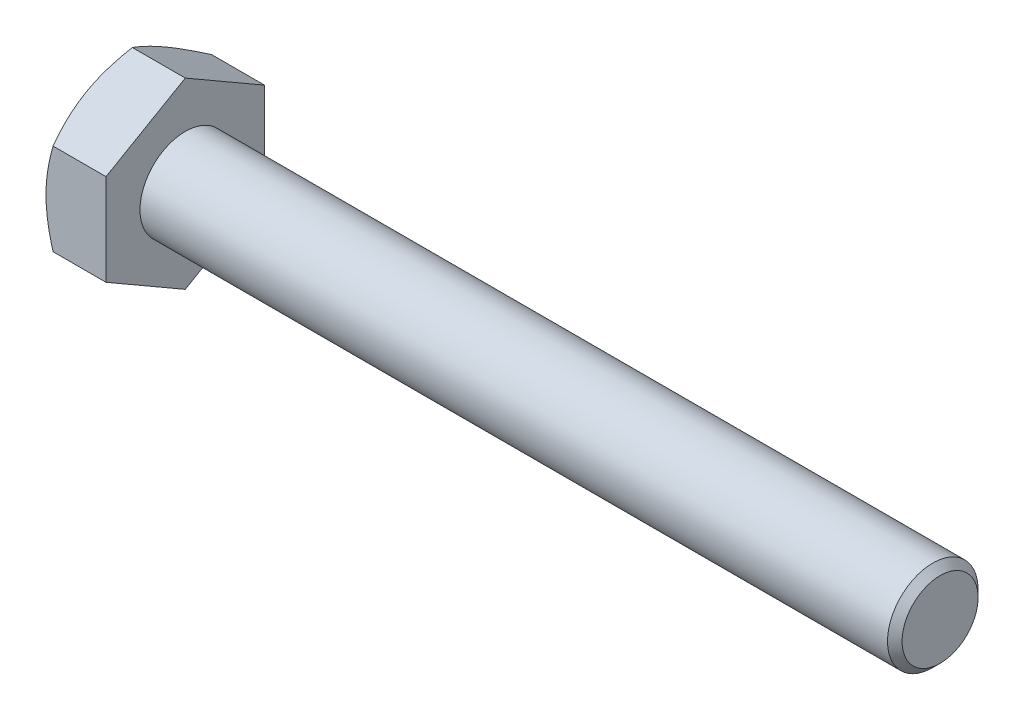
ISO-10303-21;
HEADER;
FILE_DESCRIPTION(('STEP AP214'),'2;1');
FILE_NAME('part.step','',(''),(''),'','','');
FILE_SCHEMA(('AUTOMOTIVE_DESIGN { 1 0 10303 214 1 1 1 1 }'));
ENDSEC;
DATA;
#1=APPLICATION_CONTEXT('core data for automotive mechanical design processes');
#2=APPLICATION_PROTOCOL_DEFINITION('international standard','automotive_design',2000,#1);
#3=PRODUCT_CONTEXT('',#1,'mechanical');
#4=PRODUCT('Part','Part','',(#3));
#5=PRODUCT_RELATED_PRODUCT_CATEGORY('part','',(#4));
#6=PRODUCT_DEFINITION_FORMATION('','',#4);
#7=PRODUCT_DEFINITION_CONTEXT('part definition',#1,'design');
#8=PRODUCT_DEFINITION('design','',#6,#7);
#9=PRODUCT_DEFINITION_SHAPE('','',#8);
#10=(LENGTH_UNIT() NAMED_UNIT(*) SI_UNIT(.MILLI.,.METRE.));
#11=(NAMED_UNIT(*) PLANE_ANGLE_UNIT() SI_UNIT($,.RADIAN.));
#12=(NAMED_UNIT(*) SI_UNIT($,.STERADIAN.) SOLID_ANGLE_UNIT());
#13=UNCERTAINTY_MEASURE_WITH_UNIT(LENGTH_MEASURE(1.E-05),#10,'distance_accuracy_value','');
#14=(GEOMETRIC_REPRESENTATION_CONTEXT(3) GLOBAL_UNCERTAINTY_ASSIGNED_CONTEXT((#13)) GLOBAL_UNIT_ASSIGNED_CONTEXT((#10,
#11,#12)) REPRESENTATION_CONTEXT('',''));
#15=CARTESIAN_POINT('',(0.,0.,0.));
#16=DIRECTION('',(0.,0.,1.));
#17=DIRECTION('',(1.,0.,0.));
#18=AXIS2_PLACEMENT_3D('',#15,#16,#17);
#19=CARTESIAN_POINT('',(7.95,6.06217782649107,-10.5));
#20=DIRECTION('',(0.,-0.866025403784438,0.500000000000001));
#21=DIRECTION('',(0.,-0.500000000000001,-0.866025403784438));
#22=AXIS2_PLACEMENT_3D('',#19,#20,#21);
#23=PLANE('',#22);
#24=CARTESIAN_POINT('',(0.93788884112796,12.124471123036,0.000200000000000418));
#25=CARTESIAN_POINT('',(0.860963916074867,11.9912113022033,-0.230612780289705));
#26=CARTESIAN_POINT('',(0.787530383052679,11.8574546192679,-0.462286150985755));
#27=CARTESIAN_POINT('',(0.648614855969205,11.588868624868,-0.92749073948774));
#28=CARTESIAN_POINT('',(0.583135477152654,11.4540389760651,-1.16102254158105));
#29=CARTESIAN_POINT('',(0.399895760205337,11.0473775223377,-1.86538084091668));
#30=CARTESIAN_POINT('',(0.295669956057561,10.7739403689788,-2.33898788321127));
#31=CARTESIAN_POINT('',(0.173455649415438,10.3647541884679,-3.04771913761132));
#32=CARTESIAN_POINT('',(0.138641420005218,10.2302276268794,-3.28072597725015));
#33=CARTESIAN_POINT('',(0.0802602632087882,9.96055165836838,-3.74781845629153));
#34=CARTESIAN_POINT('',(0.0566935523025239,9.82540223950837,-3.98190411637048));
#35=CARTESIAN_POINT('',(0.0214112687997663,9.554877967591,-4.45046590001193));
#36=CARTESIAN_POINT('',(0.00968161306977366,9.41950357481883,-4.68494122633711));
#37=CARTESIAN_POINT('',(-0.00167731742386433,9.14862975072206,-5.1541084521132));
#38=CARTESIAN_POINT('',(-0.00130696605018146,9.0131303233901,-5.38880034464865));
#39=CARTESIAN_POINT('',(0.0106922674925489,8.75981159790078,-5.82756124770474));
#40=CARTESIAN_POINT('',(0.0208573916341296,8.64197441901424,-6.03166122855681));
#41=CARTESIAN_POINT('',(0.0501416022118139,8.40657565830019,-6.43938384215228));
#42=CARTESIAN_POINT('',(0.0692613220254895,8.28901409655892,-6.64300644010531));
#43=CARTESIAN_POINT('',(0.139600342172595,7.93678493717292,-7.25308524006914));
#44=CARTESIAN_POINT('',(0.20379073970833,7.70274080802587,-7.65846156296505));
#45=CARTESIAN_POINT('',(0.364267089688398,7.23216993554936,-8.47351422265637));
#46=CARTESIAN_POINT('',(0.461233267874617,6.99570324614096,-8.88308654300932));
#47=CARTESIAN_POINT('',(0.681306134881991,6.52629611674996,-9.69612354054959));
#48=CARTESIAN_POINT('',(0.804361137283483,6.29334966603591,-10.0995986286292));
#49=CARTESIAN_POINT('',(0.937888841127954,6.06206235643723,-10.5002));
#50=B_SPLINE_CURVE_WITH_KNOTS('',3,(#24,#25,#26,#27,#28,#29,#30,#31,#32,#33,#34,#35,#36,#37,#38,
#39,#40,#41,#42,#43,#44,#45,#46,#47,#48,#49),.UNSPECIFIED.,.F.,.F.,(4,2,2,2,2,2,2,2,2,2,2,2,4),
(0.,0.832130250860041,1.66453336135423,3.33288308532808,4.14658222524688,4.9602970257261,
5.77304256378741,6.58576298988571,7.29326708484993,8.00082123064117,9.41693497455991,
10.864454487818,12.3091325775355),.UNSPECIFIED.);
#51=CARTESIAN_POINT('',(0.937822173508921,12.1243556529821,0.));
#52=VERTEX_POINT('',#51);
#53=CARTESIAN_POINT('',(0.,9.0932667397366,-5.25000000000001));
#54=VERTEX_POINT('',#53);
#55=EDGE_CURVE('E50',#52,#54,#50,.T.);
#56=ORIENTED_EDGE('',*,*,#55,.F.);
#57=DIRECTION('',(-1.,0.,0.));
#58=VECTOR('',#57,1.);
#59=CARTESIAN_POINT('',(7.95,12.1243556529821,0.));
#60=LINE('',#59,#58);
#61=CARTESIAN_POINT('',(7.95,12.1243556529821,0.));
#62=VERTEX_POINT('',#61);
#63=EDGE_CURVE('E146',#62,#52,#60,.T.);
#64=ORIENTED_EDGE('',*,*,#63,.F.);
#65=DIRECTION('',(0.,0.500000000000001,0.866025403784438));
#66=VECTOR('',#65,1.);
#67=CARTESIAN_POINT('',(7.95,6.06217782649107,-10.5));
#68=LINE('',#67,#66);
#69=CARTESIAN_POINT('',(7.95,6.06217782649107,-10.5));
#70=VERTEX_POINT('',#69);
#71=EDGE_CURVE('E231',#70,#62,#68,.T.);
#72=ORIENTED_EDGE('',*,*,#71,.F.);
#73=DIRECTION('',(-1.,0.,0.));
#74=VECTOR('',#73,1.);
#75=CARTESIAN_POINT('',(7.95,6.06217782649107,-10.5));
#76=LINE('',#75,#74);
#77=CARTESIAN_POINT('',(0.937822173508914,6.06217782649107,-10.5));
#78=VERTEX_POINT('',#77);
#79=EDGE_CURVE('E134',#70,#78,#76,.T.);
#80=ORIENTED_EDGE('',*,*,#79,.T.);
#81=EDGE_CURVE('E128',#54,#78,#50,.T.);
#82=ORIENTED_EDGE('',*,*,#81,.F.);
#83=EDGE_LOOP('',(#56,#64,#72,#80,#82));
#84=FACE_BOUND('',#83,.T.);
#85=ADVANCED_FACE('F34',(#84),#23,.F.);
#86=CARTESIAN_POINT('',(7.95,12.1243556529821,0.));
#87=DIRECTION('',(0.,-0.866025403784438,-0.500000000000001));
#88=DIRECTION('',(0.,0.500000000000001,-0.866025403784438));
#89=AXIS2_PLACEMENT_3D('',#86,#87,#88);
#90=PLANE('',#89);
#91=CARTESIAN_POINT('',(0.937888841127953,6.06206235643723,10.5002));
#92=CARTESIAN_POINT('',(0.860963916074859,6.19532217726989,10.2693872197103));
#93=CARTESIAN_POINT('',(0.787530383052672,6.32907886020533,10.0377138490142));
#94=CARTESIAN_POINT('',(0.648614855969198,6.5976648546052,9.57250926051226));
#95=CARTESIAN_POINT('',(0.583135477152648,6.7324945034081,9.33897745841895));
#96=CARTESIAN_POINT('',(0.399895760205332,7.13915595713548,8.63461915908332));
#97=CARTESIAN_POINT('',(0.295669956057556,7.41259311049437,8.16101211678873));
#98=CARTESIAN_POINT('',(0.173455649415434,7.82177929100534,7.45228086238868));
#99=CARTESIAN_POINT('',(0.138641420005215,7.95630585259384,7.21927402274985));
#100=CARTESIAN_POINT('',(0.0802602632087853,8.22598182110483,6.75218154370847));
#101=CARTESIAN_POINT('',(0.0566935523025206,8.36113123996485,6.51809588362952));
#102=CARTESIAN_POINT('',(0.0214112687997636,8.63165551188221,6.04953409998807));
#103=CARTESIAN_POINT('',(0.0096816130697718,8.76702990465438,5.81505877366289));
#104=CARTESIAN_POINT('',(-0.00167731742386547,9.03790372875115,5.3458915478868));
#105=CARTESIAN_POINT('',(-0.00130696605018271,9.17340315608311,5.11119965535136));
#106=CARTESIAN_POINT('',(0.0106922674925486,9.42672188157244,4.67243875229526));
#107=CARTESIAN_POINT('',(0.0208573916341302,9.54455906045897,4.46833877144319));
#108=CARTESIAN_POINT('',(0.0501416022118153,9.77995782117302,4.06061615784772));
#109=CARTESIAN_POINT('',(0.0692613220254909,9.89751938291429,3.85699355989469));
#110=CARTESIAN_POINT('',(0.139600342172597,10.2497485423003,3.24691475993086));
#111=CARTESIAN_POINT('',(0.203790739708332,10.4837926714473,2.84153843703495));
#112=CARTESIAN_POINT('',(0.364267089688401,10.9543635439239,2.02648577734363));
#113=CARTESIAN_POINT('',(0.46123326787462,11.1908302333322,1.61691345699068));
#114=CARTESIAN_POINT('',(0.681306134881996,11.6602373627233,0.803876459450407));
#115=CARTESIAN_POINT('',(0.804361137283488,11.8931838134373,0.400401371370838));
#116=CARTESIAN_POINT('',(0.93788884112796,12.124471123036,-0.000200000000000133));
#117=B_SPLINE_CURVE_WITH_KNOTS('',3,(#91,#92,#93,#94,#95,#96,#97,#98,#99,#100,#101,#102,#103,
#104,#105,#106,#107,#108,#109,#110,#111,#112,#113,#114,#115,#116),.UNSPECIFIED.,.F.,.F.,(4,2,2,
2,2,2,2,2,2,2,2,2,4),(0.,0.832130250860039,1.66453336135423,3.33288308532807,4.14658222524688,
4.96029702572609,5.77304256378741,6.5857629898857,7.29326708484992,8.00082123064116,
9.41693497455991,10.864454487818,12.3091325775355),.UNSPECIFIED.);
#118=CARTESIAN_POINT('',(0.937822173508914,6.06217782649106,10.5));
#119=VERTEX_POINT('',#118);
#120=CARTESIAN_POINT('',(0.,9.0932667397366,5.25000000000001));
#121=VERTEX_POINT('',#120);
#122=EDGE_CURVE('E57',#119,#121,#117,.T.);
#123=ORIENTED_EDGE('',*,*,#122,.F.);
#124=DIRECTION('',(-1.,0.,0.));
#125=VECTOR('',#124,1.);
#126=CARTESIAN_POINT('',(7.95,6.06217782649106,10.5));
#127=LINE('',#126,#125);
#128=CARTESIAN_POINT('',(7.95,6.06217782649106,10.5));
#129=VERTEX_POINT('',#128);
#130=EDGE_CURVE('E144',#129,#119,#127,.T.);
#131=ORIENTED_EDGE('',*,*,#130,.F.);
#132=DIRECTION('',(0.,-0.500000000000001,0.866025403784438));
#133=VECTOR('',#132,1.);
#134=CARTESIAN_POINT('',(7.95,12.1243556529821,0.));
#135=LINE('',#134,#133);
#136=EDGE_CURVE('E229',#62,#129,#135,.T.);
#137=ORIENTED_EDGE('',*,*,#136,.F.);
#138=ORIENTED_EDGE('',*,*,#63,.T.);
#139=EDGE_CURVE('E161',#121,#52,#117,.T.);
#140=ORIENTED_EDGE('',*,*,#139,.F.);
#141=EDGE_LOOP('',(#123,#131,#137,#138,#140));
#142=FACE_BOUND('',#141,.T.);
#143=ADVANCED_FACE('F167',(#142),#90,.F.);
#144=CARTESIAN_POINT('',(7.95,6.06217782649106,10.5));
#145=DIRECTION('',(0.,0.,-1.));
#146=DIRECTION('',(0.,1.,0.));
#147=AXIS2_PLACEMENT_3D('',#144,#145,#146);
#148=PLANE('',#147);
#149=CARTESIAN_POINT('',(5.22047445997533,-16.4816482140568,10.5));
#150=CARTESIAN_POINT('',(5.10841571171517,-16.2515114735599,10.5));
#151=CARTESIAN_POINT('',(4.99690095530741,-16.0211099745562,10.5));
#152=CARTESIAN_POINT('',(4.7750822478197,-15.559722280235,10.5));
#153=CARTESIAN_POINT('',(4.66477830832518,-15.3287360793489,10.5));
#154=CARTESIAN_POINT('',(4.33583913312077,-14.6347588203258,10.5));
#155=CARTESIAN_POINT('',(4.11920831465376,-14.1708141864106,10.5));
#156=CARTESIAN_POINT('',(3.69144021647065,-13.2374542365562,10.5));
#157=CARTESIAN_POINT('',(3.48033759582129,-12.768022998992,10.5));
#158=CARTESIAN_POINT('',(3.06650722260726,-11.8254960891315,10.5));
#159=CARTESIAN_POINT('',(2.8637790872997,-11.3524005854809,10.5));
#160=CARTESIAN_POINT('',(2.46224554950904,-10.3857558923946,10.5));
#161=CARTESIAN_POINT('',(2.26380321740468,-9.89205511876755,10.5));
#162=CARTESIAN_POINT('',(1.8814629725383,-8.89894764184038,10.5));
#163=CARTESIAN_POINT('',(1.69756666425613,-8.39954031602052,10.5));
#164=CARTESIAN_POINT('',(1.34900485222961,-7.39511365326189,10.5));
#165=CARTESIAN_POINT('',(1.18430206101262,-6.8901073578611,10.5));
#166=CARTESIAN_POINT('',(0.879270894971038,-5.87280589755249,10.5));
#167=CARTESIAN_POINT('',(0.73893504865889,-5.36051301919648,10.5));
#168=CARTESIAN_POINT('',(0.552073744608601,-4.58793726300861,10.5));
#169=CARTESIAN_POINT('',(0.493860241162091,-4.33046551050766,10.5));
#170=CARTESIAN_POINT('',(0.385986916267519,-3.81372703405906,10.5));
#171=CARTESIAN_POINT('',(0.336326929050838,-3.55446034499889,10.5));
#172=CARTESIAN_POINT('',(0.246424565907483,-3.03429646607582,10.5));
#173=CARTESIAN_POINT('',(0.20618199742312,-2.77339930966304,10.5));
#174=CARTESIAN_POINT('',(0.135909252260441,-2.25023434858907,10.5));
#175=CARTESIAN_POINT('',(0.105878663332123,-1.98796659969178,10.5));
#176=CARTESIAN_POINT('',(0.0570143132377911,-1.46593685398525,10.5));
#177=CARTESIAN_POINT('',(0.0380355913859236,-1.20618851046132,10.5));
#178=CARTESIAN_POINT('',(0.011088652904136,-0.686121830920444,10.5));
#179=CARTESIAN_POINT('',(0.00312024799755612,-0.425803504726466,10.5));
#180=CARTESIAN_POINT('',(-0.00161548269340232,0.0949369886886781,10.5));
#181=CARTESIAN_POINT('',(0.00161717407228305,0.35535915574744,10.5));
#182=CARTESIAN_POINT('',(0.0192021822582604,0.875830522582702,10.5));
#183=CARTESIAN_POINT('',(0.0335550415989452,1.13587970477937,10.5));
#184=CARTESIAN_POINT('',(0.080652476062602,1.75496707583259,10.5));
#185=CARTESIAN_POINT('',(0.11834553236985,2.11363731182088,10.5));
#186=CARTESIAN_POINT('',(0.21287323493008,2.82842728313809,10.5));
#187=CARTESIAN_POINT('',(0.269710320924677,3.18454668747494,10.5));
#188=CARTESIAN_POINT('',(0.465933295546483,4.24861014214033,10.5));
#189=CARTESIAN_POINT('',(0.630998761834293,4.95188760375778,10.5));
#190=CARTESIAN_POINT('',(0.918660194089463,6.00372345480017,10.5));
#191=CARTESIAN_POINT('',(1.02259898965263,6.35769943645643,10.5));
#192=CARTESIAN_POINT('',(1.24163072977517,7.06221736873328,10.5));
#193=CARTESIAN_POINT('',(1.35672375176117,7.41275929549791,10.5));
#194=CARTESIAN_POINT('',(1.59618779282069,8.11051221625829,10.5));
#195=CARTESIAN_POINT('',(1.72055601508112,8.45772417900519,10.5));
#196=CARTESIAN_POINT('',(1.97707156080398,9.1492477324347,10.5));
#197=CARTESIAN_POINT('',(2.10921876866479,9.49355936613152,10.5));
#198=CARTESIAN_POINT('',(2.44296998759923,10.3391184043912,10.5));
#199=CARTESIAN_POINT('',(2.64829832241361,10.8388935045485,10.5));
#200=CARTESIAN_POINT('',(3.06975629526235,11.833883404833,10.5));
#201=CARTESIAN_POINT('',(3.28588675525598,12.3290978545235,10.5));
#202=CARTESIAN_POINT('',(3.72667156109684,13.3158710243329,10.5));
#203=CARTESIAN_POINT('',(3.95132823824252,13.8074287000047,10.5));
#204=CARTESIAN_POINT('',(4.40735039707024,14.7873974223871,10.5));
#205=CARTESIAN_POINT('',(4.63871569859712,15.2758085531661,10.5));
#206=CARTESIAN_POINT('',(5.10713604015686,16.2506551575347,10.5));
#207=CARTESIAN_POINT('',(5.34419794777522,16.7370873249548,10.5));
#208=CARTESIAN_POINT('',(5.8227133529061,17.7077867337537,10.5));
#209=CARTESIAN_POINT('',(6.06416687416913,18.1920539634064,10.5));
#210=CARTESIAN_POINT('',(6.55064006057606,19.1586956492925,10.5));
#211=CARTESIAN_POINT('',(6.79565915421549,19.6410703934622,10.5));
#212=CARTESIAN_POINT('',(7.28869163212708,20.6042880925482,10.5));
#213=CARTESIAN_POINT('',(7.53670502871588,21.0851310411533,10.5));
#214=CARTESIAN_POINT('',(8.23932373085843,22.4387066917319,10.5));
#215=CARTESIAN_POINT('',(8.69680932414603,23.3099441586551,10.5));
#216=CARTESIAN_POINT('',(9.61789414324538,25.0492220911549,10.5));
#217=CARTESIAN_POINT('',(10.0814936344989,25.9172624158169,10.5));
#218=CARTESIAN_POINT('',(11.0120158407315,27.648395350638,10.5));
#219=CARTESIAN_POINT('',(11.4789254491471,28.5114950107133,10.5));
#220=CARTESIAN_POINT('',(12.1819662737831,29.8046526006515,10.5));
#221=CARTESIAN_POINT('',(12.4167519504062,30.2354431241638,10.5));
#222=CARTESIAN_POINT('',(12.8871248069561,31.096585572827,10.5));
#223=CARTESIAN_POINT('',(13.1227119856787,31.5269374986355,10.5));
#224=CARTESIAN_POINT('',(13.3586525810192,31.9570956307336,10.5));
#225=B_SPLINE_CURVE_WITH_KNOTS('',3,(#149,#150,#151,#152,#153,#154,#155,#156,#157,#158,#159,
#160,#161,#162,#163,#164,#165,#166,#167,#168,#169,#170,#171,#172,#173,#174,#175,#176,#177,#178,
#179,#180,#181,#182,#183,#184,#185,#186,#187,#188,#189,#190,#191,#192,#193,#194,#195,#196,#197,
#198,#199,#200,#201,#202,#203,#204,#205,#206,#207,#208,#209,#210,#211,#212,#213,#214,#215,#216,
#217,#218,#219,#220,#221,#222,#223,#224),.UNSPECIFIED.,.F.,.F.,(4,2,2,2,2,2,2,2,2,2,2,2,2,2,2,2,
2,2,2,2,2,2,2,2,2,2,2,2,2,2,2,2,2,2,2,2,2,4),(0.,0.767905398539752,1.53581813821281,
3.07186087436344,4.61593758475197,6.15994364725085,7.75603870055617,9.35230956420838,
10.9454257273475,12.5380525370423,13.3298454796426,14.1216230754322,14.9133844803533,
15.7051139186612,16.4862101446219,17.2672930136548,18.048374665853,18.8294919964201,
19.9108211856413,20.9922882331231,23.1563369158226,24.2630005252896,25.3696718171689,
26.4760107458874,27.5823332377207,29.2030865736282,30.823963424812,32.4452867065056,
34.0665664890082,35.689909996202,37.3132622852948,38.9363571817834,40.559458756917,
43.5115615357815,46.4637929082396,49.4076749676359,50.8795245740058,52.3513719698338),.UNSPECIFIED.);
#226=CARTESIAN_POINT('',(0.937822173508921,-6.06217782649108,10.5));
#227=VERTEX_POINT('',#226);
#228=CARTESIAN_POINT('',(0.,0.,10.5));
#229=VERTEX_POINT('',#228);
#230=EDGE_CURVE('E241',#227,#229,#225,.T.);
#231=ORIENTED_EDGE('',*,*,#230,.F.);
#232=DIRECTION('',(-1.,0.,0.));
#233=VECTOR('',#232,1.);
#234=CARTESIAN_POINT('',(7.95,-6.06217782649108,10.5));
#235=LINE('',#234,#233);
#236=CARTESIAN_POINT('',(7.95,-6.06217782649108,10.5));
#237=VERTEX_POINT('',#236);
#238=EDGE_CURVE('E136',#237,#227,#235,.T.);
#239=ORIENTED_EDGE('',*,*,#238,.F.);
#240=DIRECTION('',(0.,-1.,0.));
#241=VECTOR('',#240,1.);
#242=CARTESIAN_POINT('',(7.95,6.06217782649106,10.5));
#243=LINE('',#242,#241);
#244=EDGE_CURVE('E225',#129,#237,#243,.T.);
#245=ORIENTED_EDGE('',*,*,#244,.F.);
#246=ORIENTED_EDGE('',*,*,#130,.T.);
#247=EDGE_CURVE('E183',#229,#119,#225,.T.);
#248=ORIENTED_EDGE('',*,*,#247,.F.);
#249=EDGE_LOOP('',(#231,#239,#245,#246,#248));
#250=FACE_BOUND('',#249,.T.);
#251=ADVANCED_FACE('F247',(#250),#148,.F.);
#252=CARTESIAN_POINT('',(7.95,-12.1243556529822,0.));
#253=DIRECTION('',(0.,0.866025403784438,-0.500000000000001));
#254=DIRECTION('',(0.,0.500000000000001,0.866025403784438));
#255=AXIS2_PLACEMENT_3D('',#252,#253,#254);
#256=PLANE('',#255);
#257=CARTESIAN_POINT('',(0.937888841127972,-12.124471123036,-0.000200000000000162));
#258=CARTESIAN_POINT('',(0.860963916074878,-11.9912113022033,0.230612780289706));
#259=CARTESIAN_POINT('',(0.787530383052691,-11.8574546192679,0.462286150985756));
#260=CARTESIAN_POINT('',(0.648614855969216,-11.588868624868,0.927490739487743));
#261=CARTESIAN_POINT('',(0.583135477152665,-11.4540389760651,1.16102254158105));
#262=CARTESIAN_POINT('',(0.399895760205348,-11.0473775223378,1.86538084091668));
#263=CARTESIAN_POINT('',(0.295669956057572,-10.7739403689789,2.33898788321128));
#264=CARTESIAN_POINT('',(0.173455649415449,-10.3647541884679,3.04771913761133));
#265=CARTESIAN_POINT('',(0.138641420005229,-10.2302276268794,3.28072597725016));
#266=CARTESIAN_POINT('',(0.0802602632087983,-9.9605516583684,3.74781845629154));
#267=CARTESIAN_POINT('',(0.0566935523025335,-9.82540223950838,3.98190411637049));
#268=CARTESIAN_POINT('',(0.0214112687997758,-9.55487796759102,4.45046590001195));
#269=CARTESIAN_POINT('',(0.00968161306978351,-9.41950357481885,4.68494122633713));
#270=CARTESIAN_POINT('',(-0.00167731742385414,-9.14862975072208,5.15410845211321));
#271=CARTESIAN_POINT('',(-0.00130696605017131,-9.01313032339011,5.38880034464866));
#272=CARTESIAN_POINT('',(0.0106922674925593,-8.75981159790079,5.82756124770476));
#273=CARTESIAN_POINT('',(0.0208573916341402,-8.64197441901425,6.03166122855682));
#274=CARTESIAN_POINT('',(0.0501416022118243,-8.40657565830021,6.43938384215229));
#275=CARTESIAN_POINT('',(0.0692613220254997,-8.28901409655894,6.64300644010532));
#276=CARTESIAN_POINT('',(0.139600342172605,-7.93678493717294,7.25308524006915));
#277=CARTESIAN_POINT('',(0.203790739708339,-7.70274080802588,7.65846156296505));
#278=CARTESIAN_POINT('',(0.364267089688406,-7.23216993554937,8.47351422265638));
#279=CARTESIAN_POINT('',(0.461233267874625,-6.99570324614098,8.88308654300933));
#280=CARTESIAN_POINT('',(0.681306134881999,-6.52629611674998,9.6961235405496));
#281=CARTESIAN_POINT('',(0.804361137283489,-6.29334966603593,10.0995986286292));
#282=CARTESIAN_POINT('',(0.937888841127959,-6.06206235643725,10.5002));
#283=B_SPLINE_CURVE_WITH_KNOTS('',3,(#257,#258,#259,#260,#261,#262,#263,#264,#265,#266,#267,
#268,#269,#270,#271,#272,#273,#274,#275,#276,#277,#278,#279,#280,#281,#282),.UNSPECIFIED.,.F.,
.F.,(4,2,2,2,2,2,2,2,2,2,2,2,4),(0.,0.832130250860042,1.66453336135423,3.33288308532808,
4.14658222524689,4.96029702572611,5.77304256378743,6.58576298988572,7.29326708484994,
8.00082123064117,9.41693497455991,10.864454487818,12.3091325775355),.UNSPECIFIED.);
#284=CARTESIAN_POINT('',(0.937822173508932,-12.1243556529822,0.));
#285=VERTEX_POINT('',#284);
#286=CARTESIAN_POINT('',(0.,-9.0932667397366,5.25000000000001));
#287=VERTEX_POINT('',#286);
#288=EDGE_CURVE('E169',#285,#287,#283,.T.);
#289=ORIENTED_EDGE('',*,*,#288,.F.);
#290=DIRECTION('',(-1.,0.,0.));
#291=VECTOR('',#290,1.);
#292=CARTESIAN_POINT('',(7.95,-12.1243556529822,0.));
#293=LINE('',#292,#291);
#294=CARTESIAN_POINT('',(7.95,-12.1243556529822,0.));
#295=VERTEX_POINT('',#294);
#296=EDGE_CURVE('E133',#295,#285,#293,.T.);
#297=ORIENTED_EDGE('',*,*,#296,.F.);
#298=DIRECTION('',(0.,-0.500000000000001,-0.866025403784438));
#299=VECTOR('',#298,1.);
#300=CARTESIAN_POINT('',(7.95,-12.1243556529822,0.));
#301=LINE('',#300,#299);
#302=EDGE_CURVE('E223',#237,#295,#301,.T.);
#303=ORIENTED_EDGE('',*,*,#302,.F.);
#304=ORIENTED_EDGE('',*,*,#238,.T.);
#305=EDGE_CURVE('E171',#287,#227,#283,.T.);
#306=ORIENTED_EDGE('',*,*,#305,.F.);
#307=EDGE_LOOP('',(#289,#297,#303,#304,#306));
#308=FACE_BOUND('',#307,.T.);
#309=ADVANCED_FACE('F219',(#308),#256,.F.);
#310=CARTESIAN_POINT('',(7.95,-6.06217782649108,-10.5));
#311=DIRECTION('',(0.,0.866025403784438,0.500000000000001));
#312=DIRECTION('',(0.,-0.500000000000001,0.866025403784438));
#313=AXIS2_PLACEMENT_3D('',#310,#311,#312);
#314=PLANE('',#313);
#315=CARTESIAN_POINT('',(0.937888841127959,-6.06206235643725,-10.5002));
#316=CARTESIAN_POINT('',(0.860963916074865,-6.19532217726991,-10.2693872197103));
#317=CARTESIAN_POINT('',(0.787530383052678,-6.32907886020535,-10.0377138490142));
#318=CARTESIAN_POINT('',(0.648614855969205,-6.59766485460522,-9.57250926051226));
#319=CARTESIAN_POINT('',(0.583135477152656,-6.73249450340813,-9.33897745841895));
#320=CARTESIAN_POINT('',(0.399895760205341,-7.1391559571355,-8.63461915908332));
#321=CARTESIAN_POINT('',(0.295669956057565,-7.41259311049439,-8.16101211678873));
#322=CARTESIAN_POINT('',(0.173455649415443,-7.82177929100536,-7.45228086238868));
#323=CARTESIAN_POINT('',(0.138641420005224,-7.95630585259387,-7.21927402274984));
#324=CARTESIAN_POINT('',(0.0802602632087942,-8.22598182110485,-6.75218154370847));
#325=CARTESIAN_POINT('',(0.0566935523025299,-8.36113123996487,-6.51809588362951));
#326=CARTESIAN_POINT('',(0.0214112687997734,-8.63165551188223,-6.04953409998806));
#327=CARTESIAN_POINT('',(0.00968161306978183,-8.7670299046544,-5.81505877366288));
#328=CARTESIAN_POINT('',(-0.00167731742385497,-9.03790372875117,-5.3458915478868));
#329=CARTESIAN_POINT('',(-0.00130696605017198,-9.17340315608314,-5.11119965535135));
#330=CARTESIAN_POINT('',(0.0106922674925599,-9.42672188157246,-4.67243875229526));
#331=CARTESIAN_POINT('',(0.0208573916341418,-9.544559060459,-4.46833877144319));
#332=CARTESIAN_POINT('',(0.0501416022118266,-9.77995782117304,-4.06061615784772));
#333=CARTESIAN_POINT('',(0.0692613220255015,-9.89751938291431,-3.85699355989469));
#334=CARTESIAN_POINT('',(0.139600342172607,-10.2497485423003,-3.24691475993086));
#335=CARTESIAN_POINT('',(0.203790739708343,-10.4837926714474,-2.84153843703495));
#336=CARTESIAN_POINT('',(0.364267089688414,-10.9543635439239,-2.02648577734363));
#337=CARTESIAN_POINT('',(0.461233267874633,-11.1908302333323,-1.61691345699068));
#338=CARTESIAN_POINT('',(0.681306134882008,-11.6602373627233,-0.803876459450409));
#339=CARTESIAN_POINT('',(0.804361137283499,-11.8931838134373,-0.40040137137084));
#340=CARTESIAN_POINT('',(0.937888841127971,-12.124471123036,0.000199999999998961));
#341=B_SPLINE_CURVE_WITH_KNOTS('',3,(#315,#316,#317,#318,#319,#320,#321,#322,#323,#324,#325,
#326,#327,#328,#329,#330,#331,#332,#333,#334,#335,#336,#337,#338,#339,#340),.UNSPECIFIED.,.F.,
.F.,(4,2,2,2,2,2,2,2,2,2,2,2,4),(0.,0.83213025086004,1.66453336135423,3.33288308532808,
4.14658222524688,4.9602970257261,5.77304256378742,6.58576298988571,7.29326708484993,
8.00082123064116,9.41693497455991,10.864454487818,12.3091325775355),.UNSPECIFIED.);
#342=CARTESIAN_POINT('',(0.93782217350892,-6.06217782649108,-10.5));
#343=VERTEX_POINT('',#342);
#344=CARTESIAN_POINT('',(0.,-9.0932667397366,-5.25000000000001));
#345=VERTEX_POINT('',#344);
#346=EDGE_CURVE('E110',#343,#345,#341,.T.);
#347=ORIENTED_EDGE('',*,*,#346,.F.);
#348=DIRECTION('',(-1.,0.,0.));
#349=VECTOR('',#348,1.);
#350=CARTESIAN_POINT('',(7.95,-6.06217782649108,-10.5));
#351=LINE('',#350,#349);
#352=CARTESIAN_POINT('',(7.95,-6.06217782649108,-10.5));
#353=VERTEX_POINT('',#352);
#354=EDGE_CURVE('E124',#353,#343,#351,.T.);
#355=ORIENTED_EDGE('',*,*,#354,.F.);
#356=DIRECTION('',(0.,0.500000000000001,-0.866025403784438));
#357=VECTOR('',#356,1.);
#358=CARTESIAN_POINT('',(7.95,-6.06217782649108,-10.5));
#359=LINE('',#358,#357);
#360=EDGE_CURVE('E221',#295,#353,#359,.T.);
#361=ORIENTED_EDGE('',*,*,#360,.F.);
#362=ORIENTED_EDGE('',*,*,#296,.T.);
#363=EDGE_CURVE('E127',#345,#285,#341,.T.);
#364=ORIENTED_EDGE('',*,*,#363,.F.);
#365=EDGE_LOOP('',(#347,#355,#361,#362,#364));
#366=FACE_BOUND('',#365,.T.);
#367=ADVANCED_FACE('F122',(#366),#314,.F.);
#368=CARTESIAN_POINT('',(7.95,6.06217782649107,-10.5));
#369=DIRECTION('',(0.,0.,1.));
#370=DIRECTION('',(1.,0.,0.));
#371=AXIS2_PLACEMENT_3D('',#368,#369,#370);
#372=PLANE('',#371);
#373=CARTESIAN_POINT('',(5.22047445703128,-16.4816482080107,-10.5));
#374=CARTESIAN_POINT('',(5.10841570883248,-16.2515114676154,-10.5));
#375=CARTESIAN_POINT('',(4.99690095248607,-16.0211099687134,-10.5));
#376=CARTESIAN_POINT('',(4.77508224512094,-15.5597222745958,-10.5));
#377=CARTESIAN_POINT('',(4.66477830568766,-15.3287360738115,-10.5));
#378=CARTESIAN_POINT('',(4.33583913066677,-14.6347588150941,-10.5));
#379=CARTESIAN_POINT('',(4.11920831232182,-14.170814181383,-10.5));
#380=CARTESIAN_POINT('',(3.6914402143829,-13.23745423194,-10.5));
#381=CARTESIAN_POINT('',(3.48033759385564,-12.768022994583,-10.5));
#382=CARTESIAN_POINT('',(3.06650722088381,-11.8254960851383,-10.5));
#383=CARTESIAN_POINT('',(2.86377908569636,-11.3524005816963,-10.5));
#384=CARTESIAN_POINT('',(2.46224554814957,-10.3857558890439,-10.5));
#385=CARTESIAN_POINT('',(2.26380321616869,-9.89205511564219,-10.5));
#386=CARTESIAN_POINT('',(1.88146297154272,-8.89894763916934,-10.5));
#387=CARTESIAN_POINT('',(1.69756666337748,-8.39954031357845,-10.5));
#388=CARTESIAN_POINT('',(1.34900485157366,-7.39511365128198,-10.5));
#389=CARTESIAN_POINT('',(1.1843020604625,-6.89010735611436,-10.5));
#390=CARTESIAN_POINT('',(0.879270894615387,-5.87280589627852,-10.5));
#391=CARTESIAN_POINT('',(0.738935048391902,-5.36051301816209,-10.5));
#392=CARTESIAN_POINT('',(0.552073744468885,-4.58793726239646,-10.5));
#393=CARTESIAN_POINT('',(0.493860241069057,-4.33046551007582,-10.5));
#394=CARTESIAN_POINT('',(0.38598691625607,-3.81372703399041,-10.5));
#395=CARTESIAN_POINT('',(0.336326929074291,-3.55446034511314,-10.5));
#396=CARTESIAN_POINT('',(0.246424565987094,-3.03429646655789,-10.5));
#397=CARTESIAN_POINT('',(0.206181997523996,-2.77339931033003,-10.5));
#398=CARTESIAN_POINT('',(0.135909252388642,-2.2502343496275,-10.5));
#399=CARTESIAN_POINT('',(0.105878663466386,-1.98796660091673,-10.5));
#400=CARTESIAN_POINT('',(0.0570143133676668,-1.46593685557933,-10.5));
#401=CARTESIAN_POINT('',(0.0380355915056547,-1.20618851223798,-10.5));
#402=CARTESIAN_POINT('',(0.0110886529874239,-0.686121833061949,-10.5));
#403=CARTESIAN_POINT('',(0.00312024805454571,-0.425803507050226,-10.5));
#404=CARTESIAN_POINT('',(-0.00161548270481667,0.0949369860017507,-10.5));
#405=CARTESIAN_POINT('',(0.00161717401876034,0.355359152879601,-10.5));
#406=CARTESIAN_POINT('',(0.0192021821058215,0.875830519355381,-10.5));
#407=CARTESIAN_POINT('',(0.033555041389697,1.13587970137349,-10.5));
#408=CARTESIAN_POINT('',(0.0806524757136537,1.75496707215182,-10.5));
#409=CARTESIAN_POINT('',(0.11834553194055,2.11363730804458,-10.5));
#410=CARTESIAN_POINT('',(0.212873234335791,2.82842727917508,-10.5));
#411=CARTESIAN_POINT('',(0.269710320245748,3.18454668342075,-10.5));
#412=CARTESIAN_POINT('',(0.465933294611882,4.24861013781761,-10.5));
#413=CARTESIAN_POINT('',(0.630998760727018,4.95188759926314,-10.5));
#414=CARTESIAN_POINT('',(0.918660192727506,6.00372345004846,-10.5));
#415=CARTESIAN_POINT('',(1.02259898820524,6.35769943161725,-10.5));
#416=CARTESIAN_POINT('',(1.24163072815955,7.06221736372014,-10.5));
#417=CARTESIAN_POINT('',(1.35672375006275,7.41275929039829,-10.5));
#418=CARTESIAN_POINT('',(1.59618779095965,8.11051221098634,-10.5));
#419=CARTESIAN_POINT('',(1.72055601314028,8.45772417364739,-10.5));
#420=CARTESIAN_POINT('',(1.97707155870631,9.14924772690521,-10.5));
#421=CARTESIAN_POINT('',(2.1092187664901,9.49355936051618,-10.5));
#422=CARTESIAN_POINT('',(2.44296998529952,10.3391183987201,-10.5));
#423=CARTESIAN_POINT('',(2.64829832007171,10.8388934989058,-10.5));
#424=CARTESIAN_POINT('',(3.06975629284662,11.8338833992436,-10.5));
#425=CARTESIAN_POINT('',(3.2858867528086,12.3290978489591,-10.5));
#426=CARTESIAN_POINT('',(3.72667155859413,13.3158710188157,-10.5));
#427=CARTESIAN_POINT('',(3.95132823571613,13.8074286945099,-10.5));
#428=CARTESIAN_POINT('',(4.40735039450239,14.7873974169346,-10.5));
#429=CARTESIAN_POINT('',(4.63871569601148,15.2758085477336,-10.5));
#430=CARTESIAN_POINT('',(5.10713603754058,16.2506551521413,-10.5));
#431=CARTESIAN_POINT('',(5.3441979451461,16.7370873195805,-10.5));
#432=CARTESIAN_POINT('',(5.82271335025476,17.7077867284162,-10.5));
#433=CARTESIAN_POINT('',(6.06416687150841,18.1920539580865,-10.5));
#434=CARTESIAN_POINT('',(6.55064005789919,19.1586956440064,-10.5));
#435=CARTESIAN_POINT('',(6.79565915153185,19.6410703881924,-10.5));
#436=CARTESIAN_POINT('',(7.28869162943199,20.6042880873098,-10.5));
#437=CARTESIAN_POINT('',(7.53670502601612,21.0851310359301,-10.5));
#438=CARTESIAN_POINT('',(8.23932372813649,22.4387066865287,-10.5));
#439=CARTESIAN_POINT('',(8.69680932140828,23.3099441534557,-10.5));
#440=CARTESIAN_POINT('',(9.61789414047947,25.0492220859616,-10.5));
#441=CARTESIAN_POINT('',(10.0814936317206,25.9172624106259,-10.5));
#442=CARTESIAN_POINT('',(11.0120158379288,27.6483953454461,-10.5));
#443=CARTESIAN_POINT('',(11.4789254463322,28.5114950055184,-10.5));
#444=CARTESIAN_POINT('',(12.1819662709513,29.8046525954513,-10.5));
#445=CARTESIAN_POINT('',(12.4167519475689,30.2354431189618,-10.5));
#446=CARTESIAN_POINT('',(12.8871248041083,31.0965855676209,-10.5));
#447=CARTESIAN_POINT('',(13.1227119828258,31.5269374934273,-10.5));
#448=CARTESIAN_POINT('',(13.3586525781613,31.9570956255232,-10.5));
#449=B_SPLINE_CURVE_WITH_KNOTS('',3,(#373,#374,#375,#376,#377,#378,#379,#380,#381,#382,#383,
#384,#385,#386,#387,#388,#389,#390,#391,#392,#393,#394,#395,#396,#397,#398,#399,#400,#401,#402,
#403,#404,#405,#406,#407,#408,#409,#410,#411,#412,#413,#414,#415,#416,#417,#418,#419,#420,#421,
#422,#423,#424,#425,#426,#427,#428,#429,#430,#431,#432,#433,#434,#435,#436,#437,#438,#439,#440,
#441,#442,#443,#444,#445,#446,#447,#448),.UNSPECIFIED.,.F.,.F.,(4,2,2,2,2,2,2,2,2,2,2,2,2,2,2,2,
2,2,2,2,2,2,2,2,2,2,2,2,2,2,2,2,2,2,2,2,2,4),(0.,0.767905398184926,1.53581813750315,
3.07186087294403,4.61593758261534,6.15994364439705,7.75603869693699,9.35230955982357,
10.9454257221996,12.5380525311319,13.3298454731739,14.1216230684052,14.9133844727688,
15.7051139105192,16.4862101359363,17.2672930044256,18.04837465608,18.8294919861033,
19.9108211750144,20.9922882221862,23.1563369042642,24.2630005134071,25.3696718049623,
26.4760107333575,27.5823332248675,29.2030865608052,30.8239634120194,32.4452866937443,
34.0665664762782,35.6899099835067,37.3132622726342,38.936357169157,40.5594587443248,
43.5115615231775,46.4637928956241,49.4076749549949,50.879524561352,52.3513719571671),.UNSPECIFIED.);
#450=CARTESIAN_POINT('',(0.,0.,-10.5));
#451=VERTEX_POINT('',#450);
#452=EDGE_CURVE('E116',#78,#451,#449,.F.);
#453=ORIENTED_EDGE('',*,*,#452,.F.);
#454=ORIENTED_EDGE('',*,*,#79,.F.);
#455=DIRECTION('',(0.,1.,0.));
#456=VECTOR('',#455,1.);
#457=CARTESIAN_POINT('',(7.95,6.06217782649107,-10.5));
#458=LINE('',#457,#456);
#459=EDGE_CURVE('E132',#353,#70,#458,.T.);
#460=ORIENTED_EDGE('',*,*,#459,.F.);
#461=ORIENTED_EDGE('',*,*,#354,.T.);
#462=EDGE_CURVE('E107',#451,#343,#449,.F.);
#463=ORIENTED_EDGE('',*,*,#462,.F.);
#464=EDGE_LOOP('',(#453,#454,#460,#461,#463));
#465=FACE_BOUND('',#464,.T.);
#466=ADVANCED_FACE('F130',(#465),#372,.F.);
#467=CARTESIAN_POINT('',(7.95,12.1243556529821,0.));
#468=DIRECTION('',(1.,0.,0.));
#469=DIRECTION('',(0.,0.,-1.));
#470=AXIS2_PLACEMENT_3D('',#467,#468,#469);
#471=PLANE('',#470);
#472=ORIENTED_EDGE('',*,*,#71,.T.);
#473=ORIENTED_EDGE('',*,*,#136,.T.);
#474=ORIENTED_EDGE('',*,*,#244,.T.);
#475=ORIENTED_EDGE('',*,*,#302,.T.);
#476=ORIENTED_EDGE('',*,*,#360,.T.);
#477=ORIENTED_EDGE('',*,*,#459,.T.);
#478=EDGE_LOOP('',(#472,#473,#474,#475,#476,#477));
#479=FACE_BOUND('',#478,.T.);
#480=CARTESIAN_POINT('',(7.95,0.,0.));
#481=DIRECTION('',(1.,0.,0.));
#482=DIRECTION('',(0.,0.,-1.));
#483=AXIS2_PLACEMENT_3D('',#480,#481,#482);
#484=CIRCLE('',#483,6.);
#485=CARTESIAN_POINT('',(7.95,0.,-6.));
#486=VERTEX_POINT('',#485);
#487=EDGE_CURVE('E234',#486,#486,#484,.F.);
#488=ORIENTED_EDGE('',*,*,#487,.T.);
#489=EDGE_LOOP('',(#488));
#490=FACE_BOUND('',#489,.T.);
#491=ADVANCED_FACE('F249',(#479,#490),#471,.T.);
#492=CARTESIAN_POINT('',(0.,0.,0.));
#493=DIRECTION('',(-1.,0.,0.));
#494=DIRECTION('',(0.,0.,1.));
#495=AXIS2_PLACEMENT_3D('',#492,#493,#494);
#496=CYLINDRICAL_SURFACE('',#495,6.);
#497=ORIENTED_EDGE('',*,*,#487,.F.);
#498=EDGE_LOOP('',(#497));
#499=FACE_BOUND('',#498,.T.);
#500=CARTESIAN_POINT('',(106.986,0.,0.));
#501=DIRECTION('',(-1.,0.,0.));
#502=DIRECTION('',(0.,0.,1.));
#503=AXIS2_PLACEMENT_3D('',#500,#501,#502);
#504=CIRCLE('',#503,6.);
#505=CARTESIAN_POINT('',(106.986,0.,6.));
#506=VERTEX_POINT('',#505);
#507=EDGE_CURVE('E237',#506,#506,#504,.T.);
#508=ORIENTED_EDGE('',*,*,#507,.T.);
#509=EDGE_LOOP('',(#508));
#510=FACE_BOUND('',#509,.T.);
#511=ADVANCED_FACE('F281',(#499,#510),#496,.T.);
#512=CARTESIAN_POINT('',(107.95,0.,0.));
#513=DIRECTION('',(-1.,0.,0.));
#514=DIRECTION('',(0.,0.,1.));
#515=AXIS2_PLACEMENT_3D('',#512,#513,#514);
#516=CONICAL_SURFACE('',#515,5.036,0.785398163397439);
#517=ORIENTED_EDGE('',*,*,#507,.F.);
#518=EDGE_LOOP('',(#517));
#519=FACE_BOUND('',#518,.T.);
#520=CARTESIAN_POINT('',(107.95,0.,0.));
#521=DIRECTION('',(-1.,0.,0.));
#522=DIRECTION('',(0.,0.,1.));
#523=AXIS2_PLACEMENT_3D('',#520,#521,#522);
#524=CIRCLE('',#523,5.036);
#525=CARTESIAN_POINT('',(107.95,0.,5.036));
#526=VERTEX_POINT('',#525);
#527=EDGE_CURVE('E239',#526,#526,#524,.T.);
#528=ORIENTED_EDGE('',*,*,#527,.T.);
#529=EDGE_LOOP('',(#528));
#530=FACE_BOUND('',#529,.T.);
#531=ADVANCED_FACE('F283',(#519,#530),#516,.T.);
#532=CARTESIAN_POINT('',(107.95,0.,0.));
#533=DIRECTION('',(-1.,0.,0.));
#534=DIRECTION('',(0.,0.,1.));
#535=AXIS2_PLACEMENT_3D('',#532,#533,#534);
#536=PLANE('',#535);
#537=ORIENTED_EDGE('',*,*,#527,.F.);
#538=EDGE_LOOP('',(#537));
#539=FACE_BOUND('',#538,.T.);
#540=ADVANCED_FACE('F196',(#539),#536,.F.);
#541=CARTESIAN_POINT('',(0.,0.,0.));
#542=DIRECTION('',(1.,0.,0.));
#543=DIRECTION('',(0.,0.,-1.));
#544=AXIS2_PLACEMENT_3D('',#541,#542,#543);
#545=CONICAL_SURFACE('',#544,10.5,1.0471975511966);
#546=ORIENTED_EDGE('',*,*,#346,.T.);
#547=CARTESIAN_POINT('',(0.,0.,0.));
#548=DIRECTION('',(1.,0.,0.));
#549=DIRECTION('',(0.,0.,-1.));
#550=AXIS2_PLACEMENT_3D('',#547,#548,#549);
#551=CIRCLE('',#550,10.5);
#552=EDGE_CURVE('E38',#345,#451,#551,.T.);
#553=ORIENTED_EDGE('',*,*,#552,.T.);
#554=ORIENTED_EDGE('',*,*,#462,.T.);
#555=EDGE_LOOP('',(#546,#553,#554));
#556=FACE_BOUND('',#555,.T.);
#557=ADVANCED_FACE('F109',(#556),#545,.T.);
#558=ORIENTED_EDGE('',*,*,#288,.T.);
#559=EDGE_CURVE('E151',#287,#345,#551,.T.);
#560=ORIENTED_EDGE('',*,*,#559,.T.);
#561=ORIENTED_EDGE('',*,*,#363,.T.);
#562=EDGE_LOOP('',(#558,#560,#561));
#563=FACE_BOUND('',#562,.T.);
#564=ADVANCED_FACE('F195',(#563),#545,.T.);
#565=ORIENTED_EDGE('',*,*,#230,.T.);
#566=EDGE_CURVE('E152',#229,#287,#551,.T.);
#567=ORIENTED_EDGE('',*,*,#566,.T.);
#568=ORIENTED_EDGE('',*,*,#305,.T.);
#569=EDGE_LOOP('',(#565,#567,#568));
#570=FACE_BOUND('',#569,.T.);
#571=ADVANCED_FACE('F190',(#570),#545,.T.);
#572=ORIENTED_EDGE('',*,*,#247,.T.);
#573=ORIENTED_EDGE('',*,*,#122,.T.);
#574=CARTESIAN_POINT('',(0.,0.,0.));
#575=DIRECTION('',(-1.,0.,0.));
#576=DIRECTION('',(0.,0.,1.));
#577=AXIS2_PLACEMENT_3D('',#574,#575,#576);
#578=CIRCLE('',#577,10.5);
#579=EDGE_CURVE('E117',#229,#121,#578,.T.);
#580=ORIENTED_EDGE('',*,*,#579,.F.);
#581=EDGE_LOOP('',(#572,#573,#580));
#582=FACE_BOUND('',#581,.T.);
#583=ADVANCED_FACE('F194',(#582),#545,.T.);
#584=ORIENTED_EDGE('',*,*,#139,.T.);
#585=ORIENTED_EDGE('',*,*,#55,.T.);
#586=EDGE_CURVE('E43',#54,#121,#551,.T.);
#587=ORIENTED_EDGE('',*,*,#586,.T.);
#588=EDGE_LOOP('',(#584,#585,#587));
#589=FACE_BOUND('',#588,.T.);
#590=ADVANCED_FACE('F160',(#589),#545,.T.);
#591=ORIENTED_EDGE('',*,*,#81,.T.);
#592=ORIENTED_EDGE('',*,*,#452,.T.);
#593=EDGE_CURVE('E11',#451,#54,#551,.T.);
#594=ORIENTED_EDGE('',*,*,#593,.T.);
#595=EDGE_LOOP('',(#591,#592,#594));
#596=FACE_BOUND('',#595,.T.);
#597=ADVANCED_FACE('F253',(#596),#545,.T.);
#598=CARTESIAN_POINT('',(0.,12.1243556529821,0.));
#599=DIRECTION('',(1.,0.,0.));
#600=DIRECTION('',(0.,0.,-1.));
#601=AXIS2_PLACEMENT_3D('',#598,#599,#600);
#602=PLANE('',#601);
#603=ORIENTED_EDGE('',*,*,#593,.F.);
#604=ORIENTED_EDGE('',*,*,#552,.F.);
#605=ORIENTED_EDGE('',*,*,#559,.F.);
#606=ORIENTED_EDGE('',*,*,#566,.F.);
#607=ORIENTED_EDGE('',*,*,#579,.T.);
#608=ORIENTED_EDGE('',*,*,#586,.F.);
#609=EDGE_LOOP('',(#603,#604,#605,#606,#607,#608));
#610=FACE_BOUND('',#609,.T.);
#611=ADVANCED_FACE('F164',(#610),#602,.F.);
#612=CLOSED_SHELL('',(#85,#143,#251,#309,#367,#466,#491,#511,#531,#540,#557,#564,#571,#583,#590,
#597,#611));
#613=MANIFOLD_SOLID_BREP('B2',#612);
#614=ADVANCED_BREP_SHAPE_REPRESENTATION('',(#18,#613),#14);
#615=SHAPE_DEFINITION_REPRESENTATION(#9,#614);
ENDSEC;
END-ISO-10303-21;
